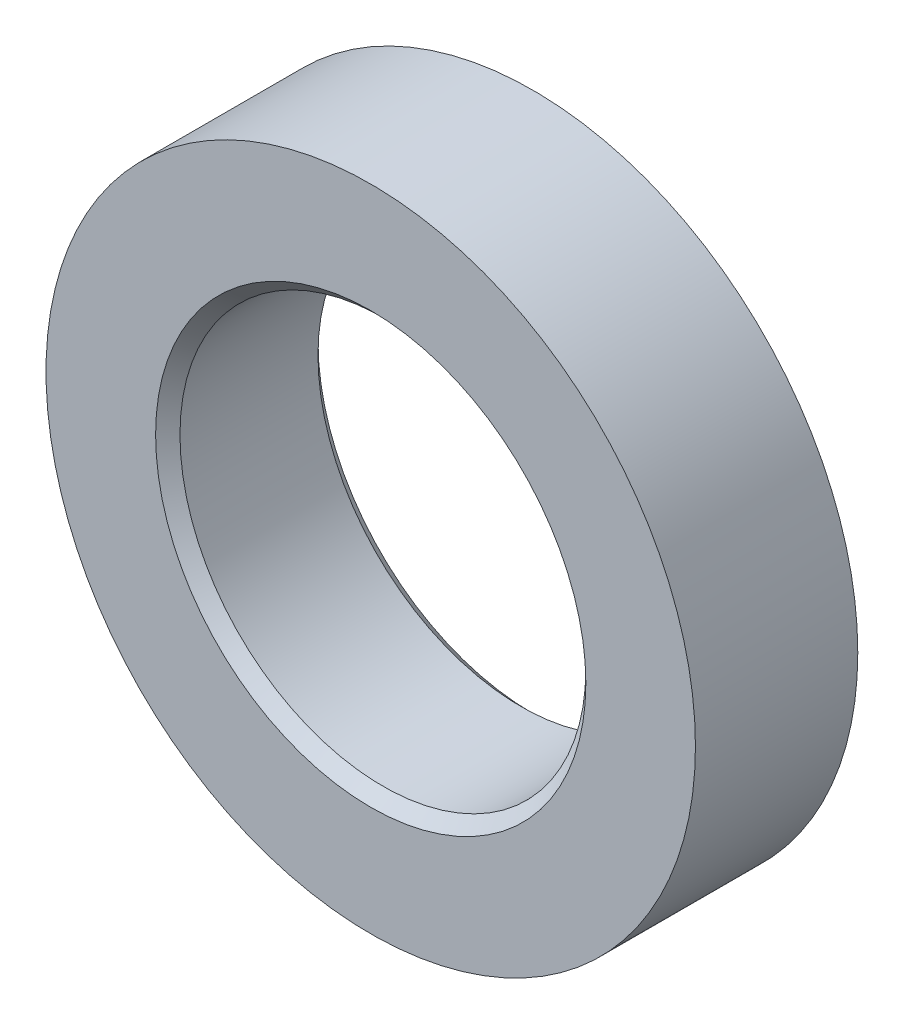
ISO-10303-21;
HEADER;
FILE_DESCRIPTION(('STEP AP214'),'2;1');
FILE_NAME('part.step','',(''),(''),'','','');
FILE_SCHEMA(('AUTOMOTIVE_DESIGN { 1 0 10303 214 1 1 1 1 }'));
ENDSEC;
DATA;
#1=APPLICATION_CONTEXT('core data for automotive mechanical design processes');
#2=APPLICATION_PROTOCOL_DEFINITION('international standard','automotive_design',2000,#1);
#3=PRODUCT_CONTEXT('',#1,'mechanical');
#4=PRODUCT('Part','Part','',(#3));
#5=PRODUCT_RELATED_PRODUCT_CATEGORY('part','',(#4));
#6=PRODUCT_DEFINITION_FORMATION('','',#4);
#7=PRODUCT_DEFINITION_CONTEXT('part definition',#1,'design');
#8=PRODUCT_DEFINITION('design','',#6,#7);
#9=PRODUCT_DEFINITION_SHAPE('','',#8);
#10=(LENGTH_UNIT() NAMED_UNIT(*) SI_UNIT(.MILLI.,.METRE.));
#11=(NAMED_UNIT(*) PLANE_ANGLE_UNIT() SI_UNIT($,.RADIAN.));
#12=(NAMED_UNIT(*) SI_UNIT($,.STERADIAN.) SOLID_ANGLE_UNIT());
#13=UNCERTAINTY_MEASURE_WITH_UNIT(LENGTH_MEASURE(1.E-05),#10,'distance_accuracy_value','');
#14=(GEOMETRIC_REPRESENTATION_CONTEXT(3) GLOBAL_UNCERTAINTY_ASSIGNED_CONTEXT((#13)) GLOBAL_UNIT_ASSIGNED_CONTEXT((#10,
#11,#12)) REPRESENTATION_CONTEXT('',''));
#15=CARTESIAN_POINT('',(0.,0.,0.));
#16=DIRECTION('',(0.,0.,1.));
#17=DIRECTION('',(1.,0.,0.));
#18=AXIS2_PLACEMENT_3D('',#15,#16,#17);
#19=CARTESIAN_POINT('',(0.,0.,4.));
#20=DIRECTION('',(0.,0.,1.));
#21=DIRECTION('',(1.,0.,0.));
#22=AXIS2_PLACEMENT_3D('',#19,#20,#21);
#23=PLANE('',#22);
#24=CARTESIAN_POINT('',(0.,0.,4.));
#25=DIRECTION('',(0.,0.,1.));
#26=DIRECTION('',(1.,0.,0.));
#27=AXIS2_PLACEMENT_3D('',#24,#25,#26);
#28=CIRCLE('',#27,5.3);
#29=CARTESIAN_POINT('',(5.3,0.,4.));
#30=VERTEX_POINT('',#29);
#31=EDGE_CURVE('E10',#30,#30,#28,.F.);
#32=ORIENTED_EDGE('',*,*,#31,.T.);
#33=EDGE_LOOP('',(#32));
#34=FACE_BOUND('',#33,.T.);
#35=CARTESIAN_POINT('',(0.,0.,4.));
#36=DIRECTION('',(0.,0.,1.));
#37=DIRECTION('',(1.,0.,0.));
#38=AXIS2_PLACEMENT_3D('',#35,#36,#37);
#39=CIRCLE('',#38,8.);
#40=CARTESIAN_POINT('',(8.,0.,4.));
#41=VERTEX_POINT('',#40);
#42=EDGE_CURVE('E64',#41,#41,#39,.T.);
#43=ORIENTED_EDGE('',*,*,#42,.T.);
#44=EDGE_LOOP('',(#43));
#45=FACE_BOUND('',#44,.T.);
#46=ADVANCED_FACE('F39',(#34,#45),#23,.T.);
#47=CARTESIAN_POINT('',(0.,0.,0.));
#48=DIRECTION('',(0.,0.,1.));
#49=DIRECTION('',(1.,0.,0.));
#50=AXIS2_PLACEMENT_3D('',#47,#48,#49);
#51=PLANE('',#50);
#52=CARTESIAN_POINT('',(0.,0.,0.));
#53=DIRECTION('',(0.,0.,1.));
#54=DIRECTION('',(1.,0.,0.));
#55=AXIS2_PLACEMENT_3D('',#52,#53,#54);
#56=CIRCLE('',#55,5.3);
#57=CARTESIAN_POINT('',(5.3,0.,0.));
#58=VERTEX_POINT('',#57);
#59=EDGE_CURVE('E58',#58,#58,#56,.T.);
#60=ORIENTED_EDGE('',*,*,#59,.T.);
#61=EDGE_LOOP('',(#60));
#62=FACE_BOUND('',#61,.T.);
#63=CARTESIAN_POINT('',(0.,0.,0.));
#64=DIRECTION('',(0.,0.,1.));
#65=DIRECTION('',(1.,0.,0.));
#66=AXIS2_PLACEMENT_3D('',#63,#64,#65);
#67=CIRCLE('',#66,8.);
#68=CARTESIAN_POINT('',(8.,0.,0.));
#69=VERTEX_POINT('',#68);
#70=EDGE_CURVE('E65',#69,#69,#67,.T.);
#71=ORIENTED_EDGE('',*,*,#70,.F.);
#72=EDGE_LOOP('',(#71));
#73=FACE_BOUND('',#72,.T.);
#74=ADVANCED_FACE('F78',(#62,#73),#51,.F.);
#75=CARTESIAN_POINT('',(0.,0.,4.));
#76=DIRECTION('',(0.,0.,-1.));
#77=DIRECTION('',(-1.,0.,0.));
#78=AXIS2_PLACEMENT_3D('',#75,#76,#77);
#79=CYLINDRICAL_SURFACE('',#78,8.);
#80=ORIENTED_EDGE('',*,*,#42,.F.);
#81=EDGE_LOOP('',(#80));
#82=FACE_BOUND('',#81,.T.);
#83=ORIENTED_EDGE('',*,*,#70,.T.);
#84=EDGE_LOOP('',(#83));
#85=FACE_BOUND('',#84,.T.);
#86=ADVANCED_FACE('F74',(#82,#85),#79,.T.);
#87=CARTESIAN_POINT('',(0.,0.,4.));
#88=DIRECTION('',(0.,0.,-1.));
#89=DIRECTION('',(-1.,0.,0.));
#90=AXIS2_PLACEMENT_3D('',#87,#88,#89);
#91=CYLINDRICAL_SURFACE('',#90,5.);
#92=CARTESIAN_POINT('',(0.,0.,0.300000000000003));
#93=DIRECTION('',(0.,0.,1.));
#94=DIRECTION('',(1.,0.,0.));
#95=AXIS2_PLACEMENT_3D('',#92,#93,#94);
#96=CIRCLE('',#95,5.);
#97=CARTESIAN_POINT('',(5.,0.,0.300000000000003));
#98=VERTEX_POINT('',#97);
#99=EDGE_CURVE('E48',#98,#98,#96,.F.);
#100=ORIENTED_EDGE('',*,*,#99,.T.);
#101=EDGE_LOOP('',(#100));
#102=FACE_BOUND('',#101,.T.);
#103=CARTESIAN_POINT('',(0.,0.,3.7));
#104=DIRECTION('',(0.,0.,1.));
#105=DIRECTION('',(1.,0.,0.));
#106=AXIS2_PLACEMENT_3D('',#103,#104,#105);
#107=CIRCLE('',#106,5.);
#108=CARTESIAN_POINT('',(5.,0.,3.7));
#109=VERTEX_POINT('',#108);
#110=EDGE_CURVE('E53',#109,#109,#107,.T.);
#111=ORIENTED_EDGE('',*,*,#110,.T.);
#112=EDGE_LOOP('',(#111));
#113=FACE_BOUND('',#112,.T.);
#114=ADVANCED_FACE('F77',(#102,#113),#91,.F.);
#115=CARTESIAN_POINT('',(0.,0.,0.));
#116=DIRECTION('',(0.,0.,-1.));
#117=DIRECTION('',(-1.,0.,0.));
#118=AXIS2_PLACEMENT_3D('',#115,#116,#117);
#119=CONICAL_SURFACE('',#118,5.3,0.785398163397444);
#120=ORIENTED_EDGE('',*,*,#99,.F.);
#121=EDGE_LOOP('',(#120));
#122=FACE_BOUND('',#121,.T.);
#123=ORIENTED_EDGE('',*,*,#59,.F.);
#124=EDGE_LOOP('',(#123));
#125=FACE_BOUND('',#124,.T.);
#126=ADVANCED_FACE('F91',(#122,#125),#119,.F.);
#127=CARTESIAN_POINT('',(0.,0.,3.7));
#128=DIRECTION('',(0.,0.,1.));
#129=DIRECTION('',(1.,0.,0.));
#130=AXIS2_PLACEMENT_3D('',#127,#128,#129);
#131=CONICAL_SURFACE('',#130,5.,0.785398163397441);
#132=ORIENTED_EDGE('',*,*,#31,.F.);
#133=EDGE_LOOP('',(#132));
#134=FACE_BOUND('',#133,.T.);
#135=ORIENTED_EDGE('',*,*,#110,.F.);
#136=EDGE_LOOP('',(#135));
#137=FACE_BOUND('',#136,.T.);
#138=ADVANCED_FACE('F42',(#134,#137),#131,.F.);
#139=CLOSED_SHELL('',(#46,#74,#86,#114,#126,#138));
#140=MANIFOLD_SOLID_BREP('B2',#139);
#141=ADVANCED_BREP_SHAPE_REPRESENTATION('',(#18,#140),#14);
#142=SHAPE_DEFINITION_REPRESENTATION(#9,#141);
ENDSEC;
END-ISO-10303-21;
